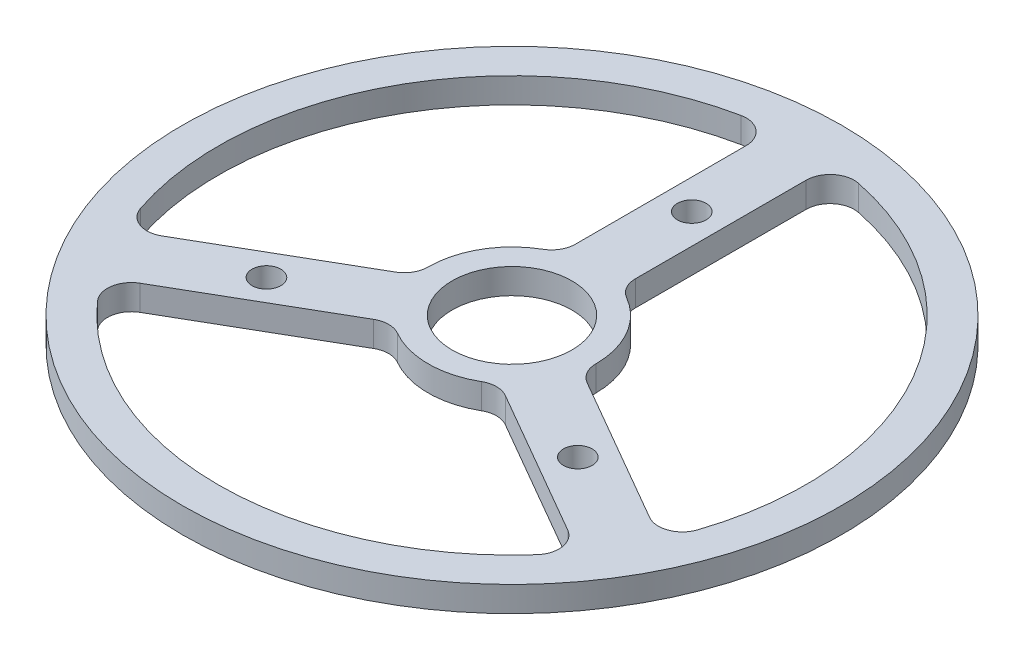
ISO-10303-21;
HEADER;
FILE_DESCRIPTION(('STEP AP214'),'2;1');
FILE_NAME('part.step','',(''),(''),'','','');
FILE_SCHEMA(('AUTOMOTIVE_DESIGN { 1 0 10303 214 1 1 1 1 }'));
ENDSEC;
DATA;
#1=APPLICATION_CONTEXT('core data for automotive mechanical design processes');
#2=APPLICATION_PROTOCOL_DEFINITION('international standard','automotive_design',2000,#1);
#3=PRODUCT_CONTEXT('',#1,'mechanical');
#4=PRODUCT('Part','Part','',(#3));
#5=PRODUCT_RELATED_PRODUCT_CATEGORY('part','',(#4));
#6=PRODUCT_DEFINITION_FORMATION('','',#4);
#7=PRODUCT_DEFINITION_CONTEXT('part definition',#1,'design');
#8=PRODUCT_DEFINITION('design','',#6,#7);
#9=PRODUCT_DEFINITION_SHAPE('','',#8);
#10=(LENGTH_UNIT() NAMED_UNIT(*) SI_UNIT(.MILLI.,.METRE.));
#11=(NAMED_UNIT(*) PLANE_ANGLE_UNIT() SI_UNIT($,.RADIAN.));
#12=(NAMED_UNIT(*) SI_UNIT($,.STERADIAN.) SOLID_ANGLE_UNIT());
#13=UNCERTAINTY_MEASURE_WITH_UNIT(LENGTH_MEASURE(1.E-05),#10,'distance_accuracy_value','');
#14=(GEOMETRIC_REPRESENTATION_CONTEXT(3) GLOBAL_UNCERTAINTY_ASSIGNED_CONTEXT((#13)) GLOBAL_UNIT_ASSIGNED_CONTEXT((#10,
#11,#12)) REPRESENTATION_CONTEXT('',''));
#15=CARTESIAN_POINT('',(0.,0.,0.));
#16=DIRECTION('',(0.,0.,1.));
#17=DIRECTION('',(1.,0.,0.));
#18=AXIS2_PLACEMENT_3D('',#15,#16,#17);
#19=CARTESIAN_POINT('',(0.,2.11,0.));
#20=DIRECTION('',(0.,-1.,0.));
#21=DIRECTION('',(0.,0.,-1.));
#22=AXIS2_PLACEMENT_3D('',#19,#20,#21);
#23=CYLINDRICAL_SURFACE('',#22,27.5);
#24=CARTESIAN_POINT('',(0.,2.11,0.));
#25=DIRECTION('',(0.,1.,0.));
#26=DIRECTION('',(0.,0.,1.));
#27=AXIS2_PLACEMENT_3D('',#24,#25,#26);
#28=CIRCLE('',#27,27.5);
#29=CARTESIAN_POINT('',(0.,2.11,27.5));
#30=VERTEX_POINT('',#29);
#31=EDGE_CURVE('E305',#30,#30,#28,.T.);
#32=ORIENTED_EDGE('',*,*,#31,.F.);
#33=EDGE_LOOP('',(#32));
#34=FACE_BOUND('',#33,.T.);
#35=CARTESIAN_POINT('',(0.,0.,0.));
#36=DIRECTION('',(0.,1.,0.));
#37=DIRECTION('',(0.,0.,1.));
#38=AXIS2_PLACEMENT_3D('',#35,#36,#37);
#39=CIRCLE('',#38,27.5);
#40=CARTESIAN_POINT('',(0.,0.,27.5));
#41=VERTEX_POINT('',#40);
#42=EDGE_CURVE('E302',#41,#41,#39,.T.);
#43=ORIENTED_EDGE('',*,*,#42,.T.);
#44=EDGE_LOOP('',(#43));
#45=FACE_BOUND('',#44,.T.);
#46=ADVANCED_FACE('F32',(#34,#45),#23,.T.);
#47=CARTESIAN_POINT('',(0.,2.11,0.));
#48=DIRECTION('',(0.,1.,0.));
#49=DIRECTION('',(0.,0.,1.));
#50=AXIS2_PLACEMENT_3D('',#47,#48,#49);
#51=PLANE('',#50);
#52=CARTESIAN_POINT('',(-12.9903810567656,2.11,7.50000000000056));
#53=DIRECTION('',(0.,1.,0.));
#54=DIRECTION('',(0.,0.,1.));
#55=AXIS2_PLACEMENT_3D('',#52,#53,#54);
#56=CIRCLE('',#55,1.20000000000122);
#57=CARTESIAN_POINT('',(-12.9903810567656,2.11,8.70000000000178));
#58=VERTEX_POINT('',#57);
#59=EDGE_CURVE('E245',#58,#58,#56,.T.);
#60=ORIENTED_EDGE('',*,*,#59,.F.);
#61=EDGE_LOOP('',(#60));
#62=FACE_BOUND('',#61,.T.);
#63=CARTESIAN_POINT('',(12.9903810567675,2.11,7.49999999999944));
#64=DIRECTION('',(0.,1.,0.));
#65=DIRECTION('',(0.,0.,1.));
#66=AXIS2_PLACEMENT_3D('',#63,#64,#65);
#67=CIRCLE('',#66,1.20000000000083);
#68=CARTESIAN_POINT('',(12.9903810567675,2.11,8.70000000000027));
#69=VERTEX_POINT('',#68);
#70=EDGE_CURVE('E261',#69,#69,#67,.T.);
#71=ORIENTED_EDGE('',*,*,#70,.F.);
#72=EDGE_LOOP('',(#71));
#73=FACE_BOUND('',#72,.T.);
#74=CARTESIAN_POINT('',(0.,2.11,-15.));
#75=DIRECTION('',(0.,1.,0.));
#76=DIRECTION('',(0.,0.,1.));
#77=AXIS2_PLACEMENT_3D('',#74,#75,#76);
#78=CIRCLE('',#77,1.2);
#79=CARTESIAN_POINT('',(0.,2.11,-13.8));
#80=VERTEX_POINT('',#79);
#81=EDGE_CURVE('E260',#80,#80,#78,.T.);
#82=ORIENTED_EDGE('',*,*,#81,.F.);
#83=EDGE_LOOP('',(#82));
#84=FACE_BOUND('',#83,.T.);
#85=CARTESIAN_POINT('',(0.,2.11,0.));
#86=DIRECTION('',(0.,-1.,0.));
#87=DIRECTION('',(0.,0.,1.));
#88=AXIS2_PLACEMENT_3D('',#85,#86,#87);
#89=CIRCLE('',#88,7.);
#90=CARTESIAN_POINT('',(-7.,2.11,0.));
#91=VERTEX_POINT('',#90);
#92=CARTESIAN_POINT('',(-3.5,2.11,-6.06217782649107));
#93=VERTEX_POINT('',#92);
#94=EDGE_CURVE('E283',#91,#93,#89,.T.);
#95=ORIENTED_EDGE('',*,*,#94,.F.);
#96=CARTESIAN_POINT('',(-9.,2.11,0.));
#97=DIRECTION('',(0.,1.,0.));
#98=DIRECTION('',(0.,0.,1.));
#99=AXIS2_PLACEMENT_3D('',#96,#97,#98);
#100=CIRCLE('',#99,2.);
#101=CARTESIAN_POINT('',(-8.,2.11,1.73205080756888));
#102=VERTEX_POINT('',#101);
#103=EDGE_CURVE('E375',#91,#102,#100,.F.);
#104=ORIENTED_EDGE('',*,*,#103,.T.);
#105=DIRECTION('',(0.866025403784439,0.,-0.5));
#106=VECTOR('',#105,1.);
#107=CARTESIAN_POINT('',(-6.91237582645306,2.11,1.10411069819441));
#108=LINE('',#107,#106);
#109=CARTESIAN_POINT('',(-20.3418830920368,2.11,8.85764033306321));
#110=VERTEX_POINT('',#109);
#111=EDGE_CURVE('E273',#110,#102,#108,.T.);
#112=ORIENTED_EDGE('',*,*,#111,.F.);
#113=CARTESIAN_POINT('',(-21.3418830920368,2.11,7.12558952549433));
#114=DIRECTION('',(0.,1.,0.));
#115=DIRECTION('',(0.,0.,1.));
#116=AXIS2_PLACEMENT_3D('',#113,#114,#115);
#117=CIRCLE('',#116,2.);
#118=CARTESIAN_POINT('',(-23.2389393668845,2.11,7.75897526109383));
#119=VERTEX_POINT('',#118);
#120=EDGE_CURVE('E383',#110,#119,#117,.F.);
#121=ORIENTED_EDGE('',*,*,#120,.T.);
#122=CARTESIAN_POINT('',(0.,2.11,0.));
#123=DIRECTION('',(0.,1.,0.));
#124=DIRECTION('',(0.,0.,1.));
#125=AXIS2_PLACEMENT_3D('',#122,#123,#124);
#126=CIRCLE('',#125,24.5);
#127=CARTESIAN_POINT('',(-4.9,2.11,-24.0049994792751));
#128=VERTEX_POINT('',#127);
#129=EDGE_CURVE('E290',#128,#119,#126,.T.);
#130=ORIENTED_EDGE('',*,*,#129,.F.);
#131=CARTESIAN_POINT('',(-4.5,2.11,-22.0454076850486));
#132=DIRECTION('',(0.,1.,0.));
#133=DIRECTION('',(0.,0.,1.));
#134=AXIS2_PLACEMENT_3D('',#131,#132,#133);
#135=CIRCLE('',#134,2.);
#136=CARTESIAN_POINT('',(-2.5,2.11,-22.0454076850486));
#137=VERTEX_POINT('',#136);
#138=EDGE_CURVE('E397',#128,#137,#135,.F.);
#139=ORIENTED_EDGE('',*,*,#138,.T.);
#140=DIRECTION('',(0.,0.,-1.));
#141=VECTOR('',#140,1.);
#142=CARTESIAN_POINT('',(-2.5,2.11,-6.53834841531101));
#143=LINE('',#142,#141);
#144=CARTESIAN_POINT('',(-2.5,2.11,-7.79422863405995));
#145=VERTEX_POINT('',#144);
#146=EDGE_CURVE('E286',#145,#137,#143,.T.);
#147=ORIENTED_EDGE('',*,*,#146,.F.);
#148=CARTESIAN_POINT('',(-4.5,2.11,-7.79422863405995));
#149=DIRECTION('',(0.,1.,0.));
#150=DIRECTION('',(0.,0.,1.));
#151=AXIS2_PLACEMENT_3D('',#148,#149,#150);
#152=CIRCLE('',#151,2.);
#153=EDGE_CURVE('E379',#145,#93,#152,.F.);
#154=ORIENTED_EDGE('',*,*,#153,.T.);
#155=EDGE_LOOP('',(#95,#104,#112,#121,#130,#139,#147,#154));
#156=FACE_BOUND('',#155,.T.);
#157=CARTESIAN_POINT('',(0.,2.11,0.));
#158=DIRECTION('',(0.,-1.,0.));
#159=DIRECTION('',(0.,0.,1.));
#160=AXIS2_PLACEMENT_3D('',#157,#158,#159);
#161=CIRCLE('',#160,7.);
#162=CARTESIAN_POINT('',(3.5,2.11,6.06217782649107));
#163=VERTEX_POINT('',#162);
#164=CARTESIAN_POINT('',(-3.5,2.11,6.06217782649107));
#165=VERTEX_POINT('',#164);
#166=EDGE_CURVE('E223',#163,#165,#161,.T.);
#167=ORIENTED_EDGE('',*,*,#166,.F.);
#168=CARTESIAN_POINT('',(4.5,2.11,7.79422863405995));
#169=DIRECTION('',(0.,1.,0.));
#170=DIRECTION('',(0.,0.,1.));
#171=AXIS2_PLACEMENT_3D('',#168,#169,#170);
#172=CIRCLE('',#171,2.);
#173=CARTESIAN_POINT('',(5.5,2.11,6.06217782649107));
#174=VERTEX_POINT('',#173);
#175=EDGE_CURVE('E363',#163,#174,#172,.F.);
#176=ORIENTED_EDGE('',*,*,#175,.T.);
#177=DIRECTION('',(-0.866025403784439,0.,-0.5));
#178=VECTOR('',#177,1.);
#179=CARTESIAN_POINT('',(4.41237582645306,2.11,5.4342377171166));
#180=LINE('',#179,#178);
#181=CARTESIAN_POINT('',(17.8418830920368,2.11,13.1877673519854));
#182=VERTEX_POINT('',#181);
#183=EDGE_CURVE('E226',#182,#174,#180,.T.);
#184=ORIENTED_EDGE('',*,*,#183,.F.);
#185=CARTESIAN_POINT('',(16.8418830920368,2.11,14.9198181595543));
#186=DIRECTION('',(0.,1.,0.));
#187=DIRECTION('',(0.,0.,1.));
#188=AXIS2_PLACEMENT_3D('',#185,#186,#187);
#189=CIRCLE('',#188,2.);
#190=CARTESIAN_POINT('',(18.3389393668845,2.11,16.2460242181813));
#191=VERTEX_POINT('',#190);
#192=EDGE_CURVE('E390',#182,#191,#189,.F.);
#193=ORIENTED_EDGE('',*,*,#192,.T.);
#194=CARTESIAN_POINT('',(0.,2.11,0.));
#195=DIRECTION('',(0.,1.,0.));
#196=DIRECTION('',(0.,0.,1.));
#197=AXIS2_PLACEMENT_3D('',#194,#195,#196);
#198=CIRCLE('',#197,24.5);
#199=CARTESIAN_POINT('',(-18.3389393668845,2.11,16.2460242181813));
#200=VERTEX_POINT('',#199);
#201=EDGE_CURVE('E222',#200,#191,#198,.T.);
#202=ORIENTED_EDGE('',*,*,#201,.F.);
#203=CARTESIAN_POINT('',(-16.8418830920368,2.11,14.9198181595543));
#204=DIRECTION('',(0.,1.,0.));
#205=DIRECTION('',(0.,0.,1.));
#206=AXIS2_PLACEMENT_3D('',#203,#204,#205);
#207=CIRCLE('',#206,2.);
#208=CARTESIAN_POINT('',(-17.8418830920368,2.11,13.1877673519854));
#209=VERTEX_POINT('',#208);
#210=EDGE_CURVE('E221',#200,#209,#207,.F.);
#211=ORIENTED_EDGE('',*,*,#210,.T.);
#212=DIRECTION('',(-0.866025403784438,0.,0.5));
#213=VECTOR('',#212,1.);
#214=CARTESIAN_POINT('',(-4.41237582645306,2.11,5.4342377171166));
#215=LINE('',#214,#213);
#216=CARTESIAN_POINT('',(-5.5,2.11,6.06217782649107));
#217=VERTEX_POINT('',#216);
#218=EDGE_CURVE('E211',#217,#209,#215,.T.);
#219=ORIENTED_EDGE('',*,*,#218,.F.);
#220=CARTESIAN_POINT('',(-4.5,2.11,7.79422863405995));
#221=DIRECTION('',(0.,1.,0.));
#222=DIRECTION('',(0.,0.,1.));
#223=AXIS2_PLACEMENT_3D('',#220,#221,#222);
#224=CIRCLE('',#223,2.);
#225=EDGE_CURVE('E194',#217,#165,#224,.F.);
#226=ORIENTED_EDGE('',*,*,#225,.T.);
#227=EDGE_LOOP('',(#167,#176,#184,#193,#202,#211,#219,#226));
#228=FACE_BOUND('',#227,.T.);
#229=CARTESIAN_POINT('',(0.,2.11,0.));
#230=DIRECTION('',(0.,-1.,0.));
#231=DIRECTION('',(0.,0.,1.));
#232=AXIS2_PLACEMENT_3D('',#229,#230,#231);
#233=CIRCLE('',#232,7.);
#234=CARTESIAN_POINT('',(3.5,2.11,-6.06217782649107));
#235=VERTEX_POINT('',#234);
#236=CARTESIAN_POINT('',(7.,2.11,0.));
#237=VERTEX_POINT('',#236);
#238=EDGE_CURVE('E246',#235,#237,#233,.T.);
#239=ORIENTED_EDGE('',*,*,#238,.F.);
#240=CARTESIAN_POINT('',(4.5,2.11,-7.79422863405995));
#241=DIRECTION('',(0.,1.,0.));
#242=DIRECTION('',(0.,0.,1.));
#243=AXIS2_PLACEMENT_3D('',#240,#241,#242);
#244=CIRCLE('',#243,2.);
#245=CARTESIAN_POINT('',(2.5,2.11,-7.79422863405995));
#246=VERTEX_POINT('',#245);
#247=EDGE_CURVE('E371',#235,#246,#244,.F.);
#248=ORIENTED_EDGE('',*,*,#247,.T.);
#249=DIRECTION('',(0.,0.,1.));
#250=VECTOR('',#249,1.);
#251=CARTESIAN_POINT('',(2.5,2.11,-6.53834841531101));
#252=LINE('',#251,#250);
#253=CARTESIAN_POINT('',(2.5,2.11,-22.0454076850486));
#254=VERTEX_POINT('',#253);
#255=EDGE_CURVE('E238',#254,#246,#252,.T.);
#256=ORIENTED_EDGE('',*,*,#255,.F.);
#257=CARTESIAN_POINT('',(4.5,2.11,-22.0454076850486));
#258=DIRECTION('',(0.,1.,0.));
#259=DIRECTION('',(0.,0.,1.));
#260=AXIS2_PLACEMENT_3D('',#257,#258,#259);
#261=CIRCLE('',#260,2.);
#262=CARTESIAN_POINT('',(4.9,2.11,-24.0049994792751));
#263=VERTEX_POINT('',#262);
#264=EDGE_CURVE('E40',#254,#263,#261,.F.);
#265=ORIENTED_EDGE('',*,*,#264,.T.);
#266=CARTESIAN_POINT('',(0.,2.11,0.));
#267=DIRECTION('',(0.,1.,0.));
#268=DIRECTION('',(0.,0.,1.));
#269=AXIS2_PLACEMENT_3D('',#266,#267,#268);
#270=CIRCLE('',#269,24.5);
#271=CARTESIAN_POINT('',(23.2389393668845,2.11,7.75897526109382));
#272=VERTEX_POINT('',#271);
#273=EDGE_CURVE('E253',#272,#263,#270,.T.);
#274=ORIENTED_EDGE('',*,*,#273,.F.);
#275=CARTESIAN_POINT('',(21.3418830920368,2.11,7.12558952549432));
#276=DIRECTION('',(0.,1.,0.));
#277=DIRECTION('',(0.,0.,1.));
#278=AXIS2_PLACEMENT_3D('',#275,#276,#277);
#279=CIRCLE('',#278,2.);
#280=CARTESIAN_POINT('',(20.3418830920368,2.11,8.8576403330632));
#281=VERTEX_POINT('',#280);
#282=EDGE_CURVE('E394',#272,#281,#279,.F.);
#283=ORIENTED_EDGE('',*,*,#282,.T.);
#284=DIRECTION('',(0.866025403784439,0.,0.5));
#285=VECTOR('',#284,1.);
#286=CARTESIAN_POINT('',(6.91237582645306,2.11,1.10411069819441));
#287=LINE('',#286,#285);
#288=CARTESIAN_POINT('',(8.,2.11,1.73205080756888));
#289=VERTEX_POINT('',#288);
#290=EDGE_CURVE('E249',#289,#281,#287,.T.);
#291=ORIENTED_EDGE('',*,*,#290,.F.);
#292=CARTESIAN_POINT('',(9.,2.11,0.));
#293=DIRECTION('',(0.,1.,0.));
#294=DIRECTION('',(0.,0.,1.));
#295=AXIS2_PLACEMENT_3D('',#292,#293,#294);
#296=CIRCLE('',#295,2.);
#297=EDGE_CURVE('E367',#289,#237,#296,.F.);
#298=ORIENTED_EDGE('',*,*,#297,.T.);
#299=EDGE_LOOP('',(#239,#248,#256,#265,#274,#283,#291,#298));
#300=FACE_BOUND('',#299,.T.);
#301=CARTESIAN_POINT('',(0.,2.11,0.));
#302=DIRECTION('',(0.,1.,0.));
#303=DIRECTION('',(0.,0.,1.));
#304=AXIS2_PLACEMENT_3D('',#301,#302,#303);
#305=CIRCLE('',#304,5.);
#306=CARTESIAN_POINT('',(0.,2.11,5.));
#307=VERTEX_POINT('',#306);
#308=EDGE_CURVE('E282',#307,#307,#305,.T.);
#309=ORIENTED_EDGE('',*,*,#308,.F.);
#310=EDGE_LOOP('',(#309));
#311=FACE_BOUND('',#310,.T.);
#312=ORIENTED_EDGE('',*,*,#31,.T.);
#313=EDGE_LOOP('',(#312));
#314=FACE_BOUND('',#313,.T.);
#315=ADVANCED_FACE('F218',(#62,#73,#84,#156,#228,#300,#311,#314),#51,.T.);
#316=CARTESIAN_POINT('',(0.,0.,0.));
#317=DIRECTION('',(0.,1.,0.));
#318=DIRECTION('',(0.,0.,1.));
#319=AXIS2_PLACEMENT_3D('',#316,#317,#318);
#320=PLANE('',#319);
#321=CARTESIAN_POINT('',(-12.9903810567656,0.,7.50000000000056));
#322=DIRECTION('',(0.,1.,0.));
#323=DIRECTION('',(0.,0.,1.));
#324=AXIS2_PLACEMENT_3D('',#321,#322,#323);
#325=CIRCLE('',#324,1.20000000000122);
#326=CARTESIAN_POINT('',(-12.9903810567656,0.,8.70000000000178));
#327=VERTEX_POINT('',#326);
#328=EDGE_CURVE('E264',#327,#327,#325,.T.);
#329=ORIENTED_EDGE('',*,*,#328,.T.);
#330=EDGE_LOOP('',(#329));
#331=FACE_BOUND('',#330,.T.);
#332=CARTESIAN_POINT('',(12.9903810567675,0.,7.49999999999944));
#333=DIRECTION('',(0.,1.,0.));
#334=DIRECTION('',(0.,0.,1.));
#335=AXIS2_PLACEMENT_3D('',#332,#333,#334);
#336=CIRCLE('',#335,1.20000000000083);
#337=CARTESIAN_POINT('',(12.9903810567675,0.,8.70000000000027));
#338=VERTEX_POINT('',#337);
#339=EDGE_CURVE('E257',#338,#338,#336,.T.);
#340=ORIENTED_EDGE('',*,*,#339,.T.);
#341=EDGE_LOOP('',(#340));
#342=FACE_BOUND('',#341,.T.);
#343=CARTESIAN_POINT('',(0.,0.,-15.));
#344=DIRECTION('',(0.,1.,0.));
#345=DIRECTION('',(0.,0.,1.));
#346=AXIS2_PLACEMENT_3D('',#343,#344,#345);
#347=CIRCLE('',#346,1.2);
#348=CARTESIAN_POINT('',(0.,0.,-13.8));
#349=VERTEX_POINT('',#348);
#350=EDGE_CURVE('E287',#349,#349,#347,.T.);
#351=ORIENTED_EDGE('',*,*,#350,.T.);
#352=EDGE_LOOP('',(#351));
#353=FACE_BOUND('',#352,.T.);
#354=CARTESIAN_POINT('',(0.,0.,0.));
#355=DIRECTION('',(0.,1.,0.));
#356=DIRECTION('',(0.,0.,1.));
#357=AXIS2_PLACEMENT_3D('',#354,#355,#356);
#358=CIRCLE('',#357,24.5);
#359=CARTESIAN_POINT('',(-4.9,0.,-24.0049994792751));
#360=VERTEX_POINT('',#359);
#361=CARTESIAN_POINT('',(-23.2389393668845,0.,7.75897526109383));
#362=VERTEX_POINT('',#361);
#363=EDGE_CURVE('E276',#360,#362,#358,.T.);
#364=ORIENTED_EDGE('',*,*,#363,.T.);
#365=CARTESIAN_POINT('',(-21.3418830920368,0.,7.12558952549433));
#366=DIRECTION('',(0.,1.,0.));
#367=DIRECTION('',(0.,0.,1.));
#368=AXIS2_PLACEMENT_3D('',#365,#366,#367);
#369=CIRCLE('',#368,2.);
#370=CARTESIAN_POINT('',(-20.3418830920368,0.,8.85764033306321));
#371=VERTEX_POINT('',#370);
#372=EDGE_CURVE('E385',#362,#371,#369,.T.);
#373=ORIENTED_EDGE('',*,*,#372,.T.);
#374=DIRECTION('',(0.866025403784439,0.,-0.5));
#375=VECTOR('',#374,1.);
#376=CARTESIAN_POINT('',(-6.91237582645306,0.,1.10411069819441));
#377=LINE('',#376,#375);
#378=CARTESIAN_POINT('',(-8.,0.,1.73205080756888));
#379=VERTEX_POINT('',#378);
#380=EDGE_CURVE('E279',#371,#379,#377,.T.);
#381=ORIENTED_EDGE('',*,*,#380,.T.);
#382=CARTESIAN_POINT('',(-9.,0.,0.));
#383=DIRECTION('',(0.,1.,0.));
#384=DIRECTION('',(0.,0.,1.));
#385=AXIS2_PLACEMENT_3D('',#382,#383,#384);
#386=CIRCLE('',#385,2.);
#387=CARTESIAN_POINT('',(-7.,0.,0.));
#388=VERTEX_POINT('',#387);
#389=EDGE_CURVE('E377',#379,#388,#386,.T.);
#390=ORIENTED_EDGE('',*,*,#389,.T.);
#391=CARTESIAN_POINT('',(0.,0.,0.));
#392=DIRECTION('',(0.,-1.,0.));
#393=DIRECTION('',(0.,0.,1.));
#394=AXIS2_PLACEMENT_3D('',#391,#392,#393);
#395=CIRCLE('',#394,7.);
#396=CARTESIAN_POINT('',(-3.5,0.,-6.06217782649107));
#397=VERTEX_POINT('',#396);
#398=EDGE_CURVE('E269',#388,#397,#395,.T.);
#399=ORIENTED_EDGE('',*,*,#398,.T.);
#400=CARTESIAN_POINT('',(-4.5,0.,-7.79422863405995));
#401=DIRECTION('',(0.,1.,0.));
#402=DIRECTION('',(0.,0.,1.));
#403=AXIS2_PLACEMENT_3D('',#400,#401,#402);
#404=CIRCLE('',#403,2.);
#405=CARTESIAN_POINT('',(-2.5,0.,-7.79422863405995));
#406=VERTEX_POINT('',#405);
#407=EDGE_CURVE('E381',#397,#406,#404,.T.);
#408=ORIENTED_EDGE('',*,*,#407,.T.);
#409=DIRECTION('',(0.,0.,-1.));
#410=VECTOR('',#409,1.);
#411=CARTESIAN_POINT('',(-2.5,0.,-6.53834841531101));
#412=LINE('',#411,#410);
#413=CARTESIAN_POINT('',(-2.5,0.,-22.0454076850486));
#414=VERTEX_POINT('',#413);
#415=EDGE_CURVE('E272',#406,#414,#412,.T.);
#416=ORIENTED_EDGE('',*,*,#415,.T.);
#417=CARTESIAN_POINT('',(-4.5,0.,-22.0454076850486));
#418=DIRECTION('',(0.,1.,0.));
#419=DIRECTION('',(0.,0.,1.));
#420=AXIS2_PLACEMENT_3D('',#417,#418,#419);
#421=CIRCLE('',#420,2.);
#422=EDGE_CURVE('E399',#414,#360,#421,.T.);
#423=ORIENTED_EDGE('',*,*,#422,.T.);
#424=EDGE_LOOP('',(#364,#373,#381,#390,#399,#408,#416,#423));
#425=FACE_BOUND('',#424,.T.);
#426=CARTESIAN_POINT('',(0.,0.,0.));
#427=DIRECTION('',(0.,1.,0.));
#428=DIRECTION('',(0.,0.,1.));
#429=AXIS2_PLACEMENT_3D('',#426,#427,#428);
#430=CIRCLE('',#429,24.5);
#431=CARTESIAN_POINT('',(-18.3389393668845,0.,16.2460242181813));
#432=VERTEX_POINT('',#431);
#433=CARTESIAN_POINT('',(18.3389393668845,0.,16.2460242181813));
#434=VERTEX_POINT('',#433);
#435=EDGE_CURVE('E490',#432,#434,#430,.T.);
#436=ORIENTED_EDGE('',*,*,#435,.T.);
#437=CARTESIAN_POINT('',(16.8418830920368,0.,14.9198181595543));
#438=DIRECTION('',(0.,1.,0.));
#439=DIRECTION('',(0.,0.,1.));
#440=AXIS2_PLACEMENT_3D('',#437,#438,#439);
#441=CIRCLE('',#440,2.);
#442=CARTESIAN_POINT('',(17.8418830920368,0.,13.1877673519854));
#443=VERTEX_POINT('',#442);
#444=EDGE_CURVE('E392',#434,#443,#441,.T.);
#445=ORIENTED_EDGE('',*,*,#444,.T.);
#446=DIRECTION('',(-0.866025403784439,0.,-0.5));
#447=VECTOR('',#446,1.);
#448=CARTESIAN_POINT('',(4.41237582645306,0.,5.4342377171166));
#449=LINE('',#448,#447);
#450=CARTESIAN_POINT('',(5.5,0.,6.06217782649107));
#451=VERTEX_POINT('',#450);
#452=EDGE_CURVE('E250',#443,#451,#449,.T.);
#453=ORIENTED_EDGE('',*,*,#452,.T.);
#454=CARTESIAN_POINT('',(4.5,0.,7.79422863405995));
#455=DIRECTION('',(0.,1.,0.));
#456=DIRECTION('',(0.,0.,1.));
#457=AXIS2_PLACEMENT_3D('',#454,#455,#456);
#458=CIRCLE('',#457,2.);
#459=CARTESIAN_POINT('',(3.5,0.,6.06217782649107));
#460=VERTEX_POINT('',#459);
#461=EDGE_CURVE('E365',#451,#460,#458,.T.);
#462=ORIENTED_EDGE('',*,*,#461,.T.);
#463=CARTESIAN_POINT('',(0.,0.,0.));
#464=DIRECTION('',(0.,-1.,0.));
#465=DIRECTION('',(0.,0.,1.));
#466=AXIS2_PLACEMENT_3D('',#463,#464,#465);
#467=CIRCLE('',#466,7.);
#468=CARTESIAN_POINT('',(-3.5,0.,6.06217782649107));
#469=VERTEX_POINT('',#468);
#470=EDGE_CURVE('E233',#460,#469,#467,.T.);
#471=ORIENTED_EDGE('',*,*,#470,.T.);
#472=CARTESIAN_POINT('',(-4.5,0.,7.79422863405995));
#473=DIRECTION('',(0.,1.,0.));
#474=DIRECTION('',(0.,0.,1.));
#475=AXIS2_PLACEMENT_3D('',#472,#473,#474);
#476=CIRCLE('',#475,2.);
#477=CARTESIAN_POINT('',(-5.5,0.,6.06217782649107));
#478=VERTEX_POINT('',#477);
#479=EDGE_CURVE('E204',#469,#478,#476,.T.);
#480=ORIENTED_EDGE('',*,*,#479,.T.);
#481=DIRECTION('',(-0.866025403784438,0.,0.5));
#482=VECTOR('',#481,1.);
#483=CARTESIAN_POINT('',(-4.41237582645306,0.,5.4342377171166));
#484=LINE('',#483,#482);
#485=CARTESIAN_POINT('',(-17.8418830920368,0.,13.1877673519854));
#486=VERTEX_POINT('',#485);
#487=EDGE_CURVE('E214',#478,#486,#484,.T.);
#488=ORIENTED_EDGE('',*,*,#487,.T.);
#489=CARTESIAN_POINT('',(-16.8418830920368,0.,14.9198181595543));
#490=DIRECTION('',(0.,1.,0.));
#491=DIRECTION('',(0.,0.,1.));
#492=AXIS2_PLACEMENT_3D('',#489,#490,#491);
#493=CIRCLE('',#492,2.);
#494=EDGE_CURVE('E388',#486,#432,#493,.T.);
#495=ORIENTED_EDGE('',*,*,#494,.T.);
#496=EDGE_LOOP('',(#436,#445,#453,#462,#471,#480,#488,#495));
#497=FACE_BOUND('',#496,.T.);
#498=CARTESIAN_POINT('',(0.,0.,0.));
#499=DIRECTION('',(0.,1.,0.));
#500=DIRECTION('',(0.,0.,1.));
#501=AXIS2_PLACEMENT_3D('',#498,#499,#500);
#502=CIRCLE('',#501,24.5);
#503=CARTESIAN_POINT('',(23.2389393668845,0.,7.75897526109382));
#504=VERTEX_POINT('',#503);
#505=CARTESIAN_POINT('',(4.9,0.,-24.0049994792751));
#506=VERTEX_POINT('',#505);
#507=EDGE_CURVE('E240',#504,#506,#502,.T.);
#508=ORIENTED_EDGE('',*,*,#507,.T.);
#509=CARTESIAN_POINT('',(4.5,0.,-22.0454076850486));
#510=DIRECTION('',(0.,1.,0.));
#511=DIRECTION('',(0.,0.,1.));
#512=AXIS2_PLACEMENT_3D('',#509,#510,#511);
#513=CIRCLE('',#512,2.);
#514=CARTESIAN_POINT('',(2.5,0.,-22.0454076850486));
#515=VERTEX_POINT('',#514);
#516=EDGE_CURVE('E11',#506,#515,#513,.T.);
#517=ORIENTED_EDGE('',*,*,#516,.T.);
#518=DIRECTION('',(0.,0.,1.));
#519=VECTOR('',#518,1.);
#520=CARTESIAN_POINT('',(2.5,0.,-6.53834841531101));
#521=LINE('',#520,#519);
#522=CARTESIAN_POINT('',(2.5,0.,-7.79422863405995));
#523=VERTEX_POINT('',#522);
#524=EDGE_CURVE('E242',#515,#523,#521,.T.);
#525=ORIENTED_EDGE('',*,*,#524,.T.);
#526=CARTESIAN_POINT('',(4.5,0.,-7.79422863405995));
#527=DIRECTION('',(0.,1.,0.));
#528=DIRECTION('',(0.,0.,1.));
#529=AXIS2_PLACEMENT_3D('',#526,#527,#528);
#530=CIRCLE('',#529,2.);
#531=CARTESIAN_POINT('',(3.5,0.,-6.06217782649107));
#532=VERTEX_POINT('',#531);
#533=EDGE_CURVE('E373',#523,#532,#530,.T.);
#534=ORIENTED_EDGE('',*,*,#533,.T.);
#535=CARTESIAN_POINT('',(0.,0.,0.));
#536=DIRECTION('',(0.,-1.,0.));
#537=DIRECTION('',(0.,0.,1.));
#538=AXIS2_PLACEMENT_3D('',#535,#536,#537);
#539=CIRCLE('',#538,7.);
#540=CARTESIAN_POINT('',(7.,0.,0.));
#541=VERTEX_POINT('',#540);
#542=EDGE_CURVE('E234',#532,#541,#539,.T.);
#543=ORIENTED_EDGE('',*,*,#542,.T.);
#544=CARTESIAN_POINT('',(9.,0.,0.));
#545=DIRECTION('',(0.,1.,0.));
#546=DIRECTION('',(0.,0.,1.));
#547=AXIS2_PLACEMENT_3D('',#544,#545,#546);
#548=CIRCLE('',#547,2.);
#549=CARTESIAN_POINT('',(8.,0.,1.73205080756888));
#550=VERTEX_POINT('',#549);
#551=EDGE_CURVE('E369',#541,#550,#548,.T.);
#552=ORIENTED_EDGE('',*,*,#551,.T.);
#553=DIRECTION('',(0.866025403784439,0.,0.5));
#554=VECTOR('',#553,1.);
#555=CARTESIAN_POINT('',(6.91237582645306,0.,1.10411069819441));
#556=LINE('',#555,#554);
#557=CARTESIAN_POINT('',(20.3418830920368,0.,8.8576403330632));
#558=VERTEX_POINT('',#557);
#559=EDGE_CURVE('E237',#550,#558,#556,.T.);
#560=ORIENTED_EDGE('',*,*,#559,.T.);
#561=CARTESIAN_POINT('',(21.3418830920368,0.,7.12558952549432));
#562=DIRECTION('',(0.,1.,0.));
#563=DIRECTION('',(0.,0.,1.));
#564=AXIS2_PLACEMENT_3D('',#561,#562,#563);
#565=CIRCLE('',#564,2.);
#566=EDGE_CURVE('E54',#558,#504,#565,.T.);
#567=ORIENTED_EDGE('',*,*,#566,.T.);
#568=EDGE_LOOP('',(#508,#517,#525,#534,#543,#552,#560,#567));
#569=FACE_BOUND('',#568,.T.);
#570=CARTESIAN_POINT('',(0.,0.,0.));
#571=DIRECTION('',(0.,1.,0.));
#572=DIRECTION('',(0.,0.,1.));
#573=AXIS2_PLACEMENT_3D('',#570,#571,#572);
#574=CIRCLE('',#573,5.);
#575=CARTESIAN_POINT('',(0.,0.,5.));
#576=VERTEX_POINT('',#575);
#577=EDGE_CURVE('E299',#576,#576,#574,.T.);
#578=ORIENTED_EDGE('',*,*,#577,.T.);
#579=EDGE_LOOP('',(#578));
#580=FACE_BOUND('',#579,.T.);
#581=ORIENTED_EDGE('',*,*,#42,.F.);
#582=EDGE_LOOP('',(#581));
#583=FACE_BOUND('',#582,.T.);
#584=ADVANCED_FACE('F410',(#331,#342,#353,#425,#497,#569,#580,#583),#320,.F.);
#585=CARTESIAN_POINT('',(0.,0.,0.));
#586=DIRECTION('',(0.,1.,0.));
#587=DIRECTION('',(0.,0.,1.));
#588=AXIS2_PLACEMENT_3D('',#585,#586,#587);
#589=CYLINDRICAL_SURFACE('',#588,5.);
#590=ORIENTED_EDGE('',*,*,#577,.F.);
#591=EDGE_LOOP('',(#590));
#592=FACE_BOUND('',#591,.T.);
#593=ORIENTED_EDGE('',*,*,#308,.T.);
#594=EDGE_LOOP('',(#593));
#595=FACE_BOUND('',#594,.T.);
#596=ADVANCED_FACE('F531',(#592,#595),#589,.F.);
#597=CARTESIAN_POINT('',(0.,0.,0.));
#598=DIRECTION('',(0.,1.,0.));
#599=DIRECTION('',(0.,0.,1.));
#600=AXIS2_PLACEMENT_3D('',#597,#598,#599);
#601=CYLINDRICAL_SURFACE('',#600,7.);
#602=ORIENTED_EDGE('',*,*,#238,.T.);
#603=DIRECTION('',(0.,1.,0.));
#604=VECTOR('',#603,1.);
#605=CARTESIAN_POINT('',(7.,0.,0.));
#606=LINE('',#605,#604);
#607=EDGE_CURVE('E327',#237,#541,#606,.F.);
#608=ORIENTED_EDGE('',*,*,#607,.T.);
#609=ORIENTED_EDGE('',*,*,#542,.F.);
#610=DIRECTION('',(0.,1.,0.));
#611=VECTOR('',#610,1.);
#612=CARTESIAN_POINT('',(3.5,0.,-6.06217782649107));
#613=LINE('',#612,#611);
#614=EDGE_CURVE('E324',#532,#235,#613,.T.);
#615=ORIENTED_EDGE('',*,*,#614,.T.);
#616=EDGE_LOOP('',(#602,#608,#609,#615));
#617=FACE_BOUND('',#616,.T.);
#618=ADVANCED_FACE('F422',(#617),#601,.T.);
#619=CARTESIAN_POINT('',(2.5,0.,-6.53834841531101));
#620=DIRECTION('',(-1.,0.,0.));
#621=DIRECTION('',(0.,0.,1.));
#622=AXIS2_PLACEMENT_3D('',#619,#620,#621);
#623=PLANE('',#622);
#624=ORIENTED_EDGE('',*,*,#255,.T.);
#625=DIRECTION('',(0.,-1.,0.));
#626=VECTOR('',#625,1.);
#627=CARTESIAN_POINT('',(2.5,0.,-7.79422863405995));
#628=LINE('',#627,#626);
#629=EDGE_CURVE('E332',#246,#523,#628,.T.);
#630=ORIENTED_EDGE('',*,*,#629,.T.);
#631=ORIENTED_EDGE('',*,*,#524,.F.);
#632=DIRECTION('',(0.,-1.,0.));
#633=VECTOR('',#632,1.);
#634=CARTESIAN_POINT('',(2.5,2.11,-22.0454076850486));
#635=LINE('',#634,#633);
#636=EDGE_CURVE('E329',#515,#254,#635,.F.);
#637=ORIENTED_EDGE('',*,*,#636,.T.);
#638=EDGE_LOOP('',(#624,#630,#631,#637));
#639=FACE_BOUND('',#638,.T.);
#640=ADVANCED_FACE('F414',(#639),#623,.F.);
#641=CARTESIAN_POINT('',(0.,0.,0.));
#642=DIRECTION('',(0.,1.,0.));
#643=DIRECTION('',(0.,0.,1.));
#644=AXIS2_PLACEMENT_3D('',#641,#642,#643);
#645=CYLINDRICAL_SURFACE('',#644,24.5);
#646=ORIENTED_EDGE('',*,*,#507,.F.);
#647=DIRECTION('',(0.,1.,0.));
#648=VECTOR('',#647,1.);
#649=CARTESIAN_POINT('',(23.2389393668845,0.,7.75897526109382));
#650=LINE('',#649,#648);
#651=EDGE_CURVE('E205',#504,#272,#650,.T.);
#652=ORIENTED_EDGE('',*,*,#651,.T.);
#653=ORIENTED_EDGE('',*,*,#273,.T.);
#654=DIRECTION('',(0.,1.,0.));
#655=VECTOR('',#654,1.);
#656=CARTESIAN_POINT('',(4.9,0.,-24.0049994792751));
#657=LINE('',#656,#655);
#658=EDGE_CURVE('E47',#263,#506,#657,.F.);
#659=ORIENTED_EDGE('',*,*,#658,.T.);
#660=EDGE_LOOP('',(#646,#652,#653,#659));
#661=FACE_BOUND('',#660,.T.);
#662=ADVANCED_FACE('F406',(#661),#645,.F.);
#663=CARTESIAN_POINT('',(6.91237582645306,0.,1.10411069819441));
#664=DIRECTION('',(-0.5,0.,0.866025403784439));
#665=DIRECTION('',(0.866025403784439,0.,0.5));
#666=AXIS2_PLACEMENT_3D('',#663,#664,#665);
#667=PLANE('',#666);
#668=ORIENTED_EDGE('',*,*,#559,.F.);
#669=DIRECTION('',(0.,-1.,0.));
#670=VECTOR('',#669,1.);
#671=CARTESIAN_POINT('',(8.,2.11,1.73205080756888));
#672=LINE('',#671,#670);
#673=EDGE_CURVE('E321',#550,#289,#672,.F.);
#674=ORIENTED_EDGE('',*,*,#673,.T.);
#675=ORIENTED_EDGE('',*,*,#290,.T.);
#676=DIRECTION('',(0.,-1.,0.));
#677=VECTOR('',#676,1.);
#678=CARTESIAN_POINT('',(20.3418830920368,0.,8.8576403330632));
#679=LINE('',#678,#677);
#680=EDGE_CURVE('E319',#281,#558,#679,.T.);
#681=ORIENTED_EDGE('',*,*,#680,.T.);
#682=EDGE_LOOP('',(#668,#674,#675,#681));
#683=FACE_BOUND('',#682,.T.);
#684=ADVANCED_FACE('F429',(#683),#667,.F.);
#685=CARTESIAN_POINT('',(0.,0.,0.));
#686=DIRECTION('',(0.,1.,0.));
#687=DIRECTION('',(0.,0.,1.));
#688=AXIS2_PLACEMENT_3D('',#685,#686,#687);
#689=CYLINDRICAL_SURFACE('',#688,7.);
#690=ORIENTED_EDGE('',*,*,#166,.T.);
#691=DIRECTION('',(0.,1.,0.));
#692=VECTOR('',#691,1.);
#693=CARTESIAN_POINT('',(-3.5,0.,6.06217782649107));
#694=LINE('',#693,#692);
#695=EDGE_CURVE('E199',#165,#469,#694,.F.);
#696=ORIENTED_EDGE('',*,*,#695,.T.);
#697=ORIENTED_EDGE('',*,*,#470,.F.);
#698=DIRECTION('',(0.,1.,0.));
#699=VECTOR('',#698,1.);
#700=CARTESIAN_POINT('',(3.5,0.,6.06217782649107));
#701=LINE('',#700,#699);
#702=EDGE_CURVE('E215',#460,#163,#701,.T.);
#703=ORIENTED_EDGE('',*,*,#702,.T.);
#704=EDGE_LOOP('',(#690,#696,#697,#703));
#705=FACE_BOUND('',#704,.T.);
#706=ADVANCED_FACE('F504',(#705),#689,.T.);
#707=CARTESIAN_POINT('',(4.41237582645306,0.,5.4342377171166));
#708=DIRECTION('',(0.5,0.,-0.866025403784439));
#709=DIRECTION('',(-0.866025403784439,0.,-0.5));
#710=AXIS2_PLACEMENT_3D('',#707,#708,#709);
#711=PLANE('',#710);
#712=ORIENTED_EDGE('',*,*,#183,.T.);
#713=DIRECTION('',(0.,-1.,0.));
#714=VECTOR('',#713,1.);
#715=CARTESIAN_POINT('',(5.5,0.,6.06217782649107));
#716=LINE('',#715,#714);
#717=EDGE_CURVE('E317',#174,#451,#716,.T.);
#718=ORIENTED_EDGE('',*,*,#717,.T.);
#719=ORIENTED_EDGE('',*,*,#452,.F.);
#720=DIRECTION('',(0.,-1.,0.));
#721=VECTOR('',#720,1.);
#722=CARTESIAN_POINT('',(17.8418830920368,2.11,13.1877673519854));
#723=LINE('',#722,#721);
#724=EDGE_CURVE('E314',#443,#182,#723,.F.);
#725=ORIENTED_EDGE('',*,*,#724,.T.);
#726=EDGE_LOOP('',(#712,#718,#719,#725));
#727=FACE_BOUND('',#726,.T.);
#728=ADVANCED_FACE('F508',(#727),#711,.F.);
#729=CARTESIAN_POINT('',(0.,0.,0.));
#730=DIRECTION('',(0.,1.,0.));
#731=DIRECTION('',(0.,0.,1.));
#732=AXIS2_PLACEMENT_3D('',#729,#730,#731);
#733=CYLINDRICAL_SURFACE('',#732,24.5);
#734=ORIENTED_EDGE('',*,*,#435,.F.);
#735=DIRECTION('',(0.,1.,0.));
#736=VECTOR('',#735,1.);
#737=CARTESIAN_POINT('',(-18.3389393668845,0.,16.2460242181813));
#738=LINE('',#737,#736);
#739=EDGE_CURVE('E356',#432,#200,#738,.T.);
#740=ORIENTED_EDGE('',*,*,#739,.T.);
#741=ORIENTED_EDGE('',*,*,#201,.T.);
#742=DIRECTION('',(0.,1.,0.));
#743=VECTOR('',#742,1.);
#744=CARTESIAN_POINT('',(18.3389393668845,0.,16.2460242181813));
#745=LINE('',#744,#743);
#746=EDGE_CURVE('E354',#191,#434,#745,.F.);
#747=ORIENTED_EDGE('',*,*,#746,.T.);
#748=EDGE_LOOP('',(#734,#740,#741,#747));
#749=FACE_BOUND('',#748,.T.);
#750=ADVANCED_FACE('F493',(#749),#733,.F.);
#751=CARTESIAN_POINT('',(-4.41237582645306,0.,5.4342377171166));
#752=DIRECTION('',(-0.5,0.,-0.866025403784438));
#753=DIRECTION('',(-0.866025403784439,0.,0.5));
#754=AXIS2_PLACEMENT_3D('',#751,#752,#753);
#755=PLANE('',#754);
#756=ORIENTED_EDGE('',*,*,#487,.F.);
#757=DIRECTION('',(0.,-1.,0.));
#758=VECTOR('',#757,1.);
#759=CARTESIAN_POINT('',(-5.5,2.11,6.06217782649107));
#760=LINE('',#759,#758);
#761=EDGE_CURVE('E198',#478,#217,#760,.F.);
#762=ORIENTED_EDGE('',*,*,#761,.T.);
#763=ORIENTED_EDGE('',*,*,#218,.T.);
#764=DIRECTION('',(0.,-1.,0.));
#765=VECTOR('',#764,1.);
#766=CARTESIAN_POINT('',(-17.8418830920368,0.,13.1877673519854));
#767=LINE('',#766,#765);
#768=EDGE_CURVE('E216',#209,#486,#767,.T.);
#769=ORIENTED_EDGE('',*,*,#768,.T.);
#770=EDGE_LOOP('',(#756,#762,#763,#769));
#771=FACE_BOUND('',#770,.T.);
#772=ADVANCED_FACE('F210',(#771),#755,.F.);
#773=CARTESIAN_POINT('',(0.,0.,0.));
#774=DIRECTION('',(0.,1.,0.));
#775=DIRECTION('',(0.,0.,1.));
#776=AXIS2_PLACEMENT_3D('',#773,#774,#775);
#777=CYLINDRICAL_SURFACE('',#776,7.);
#778=ORIENTED_EDGE('',*,*,#398,.F.);
#779=DIRECTION('',(0.,1.,0.));
#780=VECTOR('',#779,1.);
#781=CARTESIAN_POINT('',(-7.,0.,0.));
#782=LINE('',#781,#780);
#783=EDGE_CURVE('E336',#388,#91,#782,.T.);
#784=ORIENTED_EDGE('',*,*,#783,.T.);
#785=ORIENTED_EDGE('',*,*,#94,.T.);
#786=DIRECTION('',(0.,1.,0.));
#787=VECTOR('',#786,1.);
#788=CARTESIAN_POINT('',(-3.5,0.,-6.06217782649107));
#789=LINE('',#788,#787);
#790=EDGE_CURVE('E334',#93,#397,#789,.F.);
#791=ORIENTED_EDGE('',*,*,#790,.T.);
#792=EDGE_LOOP('',(#778,#784,#785,#791));
#793=FACE_BOUND('',#792,.T.);
#794=ADVANCED_FACE('F521',(#793),#777,.T.);
#795=CARTESIAN_POINT('',(-6.91237582645306,0.,1.10411069819441));
#796=DIRECTION('',(0.5,0.,0.866025403784439));
#797=DIRECTION('',(0.866025403784439,0.,-0.5));
#798=AXIS2_PLACEMENT_3D('',#795,#796,#797);
#799=PLANE('',#798);
#800=ORIENTED_EDGE('',*,*,#111,.T.);
#801=DIRECTION('',(0.,-1.,0.));
#802=VECTOR('',#801,1.);
#803=CARTESIAN_POINT('',(-8.,0.,1.73205080756888));
#804=LINE('',#803,#802);
#805=EDGE_CURVE('E342',#102,#379,#804,.T.);
#806=ORIENTED_EDGE('',*,*,#805,.T.);
#807=ORIENTED_EDGE('',*,*,#380,.F.);
#808=DIRECTION('',(0.,-1.,0.));
#809=VECTOR('',#808,1.);
#810=CARTESIAN_POINT('',(-20.3418830920368,2.11,8.85764033306321));
#811=LINE('',#810,#809);
#812=EDGE_CURVE('E339',#371,#110,#811,.F.);
#813=ORIENTED_EDGE('',*,*,#812,.T.);
#814=EDGE_LOOP('',(#800,#806,#807,#813));
#815=FACE_BOUND('',#814,.T.);
#816=ADVANCED_FACE('F540',(#815),#799,.F.);
#817=CARTESIAN_POINT('',(0.,0.,0.));
#818=DIRECTION('',(0.,1.,0.));
#819=DIRECTION('',(0.,0.,1.));
#820=AXIS2_PLACEMENT_3D('',#817,#818,#819);
#821=CYLINDRICAL_SURFACE('',#820,24.5);
#822=ORIENTED_EDGE('',*,*,#129,.T.);
#823=DIRECTION('',(0.,1.,0.));
#824=VECTOR('',#823,1.);
#825=CARTESIAN_POINT('',(-23.2389393668845,0.,7.75897526109383));
#826=LINE('',#825,#824);
#827=EDGE_CURVE('E352',#119,#362,#826,.F.);
#828=ORIENTED_EDGE('',*,*,#827,.T.);
#829=ORIENTED_EDGE('',*,*,#363,.F.);
#830=DIRECTION('',(0.,1.,0.));
#831=VECTOR('',#830,1.);
#832=CARTESIAN_POINT('',(-4.9,0.,-24.0049994792751));
#833=LINE('',#832,#831);
#834=EDGE_CURVE('E349',#360,#128,#833,.T.);
#835=ORIENTED_EDGE('',*,*,#834,.T.);
#836=EDGE_LOOP('',(#822,#828,#829,#835));
#837=FACE_BOUND('',#836,.T.);
#838=ADVANCED_FACE('F543',(#837),#821,.F.);
#839=CARTESIAN_POINT('',(-2.5,0.,-6.53834841531101));
#840=DIRECTION('',(1.,0.,0.));
#841=DIRECTION('',(0.,0.,-1.));
#842=AXIS2_PLACEMENT_3D('',#839,#840,#841);
#843=PLANE('',#842);
#844=ORIENTED_EDGE('',*,*,#415,.F.);
#845=DIRECTION('',(0.,-1.,0.));
#846=VECTOR('',#845,1.);
#847=CARTESIAN_POINT('',(-2.5,2.11,-7.79422863405995));
#848=LINE('',#847,#846);
#849=EDGE_CURVE('E346',#406,#145,#848,.F.);
#850=ORIENTED_EDGE('',*,*,#849,.T.);
#851=ORIENTED_EDGE('',*,*,#146,.T.);
#852=DIRECTION('',(0.,-1.,0.));
#853=VECTOR('',#852,1.);
#854=CARTESIAN_POINT('',(-2.5,0.,-22.0454076850486));
#855=LINE('',#854,#853);
#856=EDGE_CURVE('E344',#137,#414,#855,.T.);
#857=ORIENTED_EDGE('',*,*,#856,.T.);
#858=EDGE_LOOP('',(#844,#850,#851,#857));
#859=FACE_BOUND('',#858,.T.);
#860=ADVANCED_FACE('F547',(#859),#843,.F.);
#861=CARTESIAN_POINT('',(0.,0.,-15.));
#862=DIRECTION('',(0.,1.,0.));
#863=DIRECTION('',(0.,0.,1.));
#864=AXIS2_PLACEMENT_3D('',#861,#862,#863);
#865=CYLINDRICAL_SURFACE('',#864,1.2);
#866=ORIENTED_EDGE('',*,*,#350,.F.);
#867=EDGE_LOOP('',(#866));
#868=FACE_BOUND('',#867,.T.);
#869=ORIENTED_EDGE('',*,*,#81,.T.);
#870=EDGE_LOOP('',(#869));
#871=FACE_BOUND('',#870,.T.);
#872=ADVANCED_FACE('F535',(#868,#871),#865,.F.);
#873=CARTESIAN_POINT('',(12.9903810567675,0.,7.49999999999944));
#874=DIRECTION('',(0.,1.,0.));
#875=DIRECTION('',(0.,0.,1.));
#876=AXIS2_PLACEMENT_3D('',#873,#874,#875);
#877=CYLINDRICAL_SURFACE('',#876,1.20000000000083);
#878=ORIENTED_EDGE('',*,*,#339,.F.);
#879=EDGE_LOOP('',(#878));
#880=FACE_BOUND('',#879,.T.);
#881=ORIENTED_EDGE('',*,*,#70,.T.);
#882=EDGE_LOOP('',(#881));
#883=FACE_BOUND('',#882,.T.);
#884=ADVANCED_FACE('F532',(#880,#883),#877,.F.);
#885=CARTESIAN_POINT('',(-12.9903810567656,0.,7.50000000000056));
#886=DIRECTION('',(0.,1.,0.));
#887=DIRECTION('',(0.,0.,1.));
#888=AXIS2_PLACEMENT_3D('',#885,#886,#887);
#889=CYLINDRICAL_SURFACE('',#888,1.20000000000122);
#890=ORIENTED_EDGE('',*,*,#328,.F.);
#891=EDGE_LOOP('',(#890));
#892=FACE_BOUND('',#891,.T.);
#893=ORIENTED_EDGE('',*,*,#59,.T.);
#894=EDGE_LOOP('',(#893));
#895=FACE_BOUND('',#894,.T.);
#896=ADVANCED_FACE('F461',(#892,#895),#889,.F.);
#897=CARTESIAN_POINT('',(-4.5,0.,7.79422863405995));
#898=DIRECTION('',(0.,1.,0.));
#899=DIRECTION('',(0.,0.,1.));
#900=AXIS2_PLACEMENT_3D('',#897,#898,#899);
#901=CYLINDRICAL_SURFACE('',#900,2.);
#902=ORIENTED_EDGE('',*,*,#479,.F.);
#903=ORIENTED_EDGE('',*,*,#695,.F.);
#904=ORIENTED_EDGE('',*,*,#225,.F.);
#905=ORIENTED_EDGE('',*,*,#761,.F.);
#906=EDGE_LOOP('',(#902,#903,#904,#905));
#907=FACE_BOUND('',#906,.T.);
#908=ADVANCED_FACE('F197',(#907),#901,.F.);
#909=CARTESIAN_POINT('',(4.5,0.,7.79422863405995));
#910=DIRECTION('',(0.,1.,0.));
#911=DIRECTION('',(0.,0.,1.));
#912=AXIS2_PLACEMENT_3D('',#909,#910,#911);
#913=CYLINDRICAL_SURFACE('',#912,2.);
#914=ORIENTED_EDGE('',*,*,#461,.F.);
#915=ORIENTED_EDGE('',*,*,#717,.F.);
#916=ORIENTED_EDGE('',*,*,#175,.F.);
#917=ORIENTED_EDGE('',*,*,#702,.F.);
#918=EDGE_LOOP('',(#914,#915,#916,#917));
#919=FACE_BOUND('',#918,.T.);
#920=ADVANCED_FACE('F460',(#919),#913,.F.);
#921=CARTESIAN_POINT('',(9.,0.,0.));
#922=DIRECTION('',(0.,1.,0.));
#923=DIRECTION('',(0.,0.,1.));
#924=AXIS2_PLACEMENT_3D('',#921,#922,#923);
#925=CYLINDRICAL_SURFACE('',#924,2.);
#926=ORIENTED_EDGE('',*,*,#551,.F.);
#927=ORIENTED_EDGE('',*,*,#607,.F.);
#928=ORIENTED_EDGE('',*,*,#297,.F.);
#929=ORIENTED_EDGE('',*,*,#673,.F.);
#930=EDGE_LOOP('',(#926,#927,#928,#929));
#931=FACE_BOUND('',#930,.T.);
#932=ADVANCED_FACE('F425',(#931),#925,.F.);
#933=CARTESIAN_POINT('',(4.5,0.,-7.79422863405995));
#934=DIRECTION('',(0.,1.,0.));
#935=DIRECTION('',(0.,0.,1.));
#936=AXIS2_PLACEMENT_3D('',#933,#934,#935);
#937=CYLINDRICAL_SURFACE('',#936,2.);
#938=ORIENTED_EDGE('',*,*,#533,.F.);
#939=ORIENTED_EDGE('',*,*,#629,.F.);
#940=ORIENTED_EDGE('',*,*,#247,.F.);
#941=ORIENTED_EDGE('',*,*,#614,.F.);
#942=EDGE_LOOP('',(#938,#939,#940,#941));
#943=FACE_BOUND('',#942,.T.);
#944=ADVANCED_FACE('F417',(#943),#937,.F.);
#945=CARTESIAN_POINT('',(-9.,0.,0.));
#946=DIRECTION('',(0.,1.,0.));
#947=DIRECTION('',(0.,0.,1.));
#948=AXIS2_PLACEMENT_3D('',#945,#946,#947);
#949=CYLINDRICAL_SURFACE('',#948,2.);
#950=ORIENTED_EDGE('',*,*,#389,.F.);
#951=ORIENTED_EDGE('',*,*,#805,.F.);
#952=ORIENTED_EDGE('',*,*,#103,.F.);
#953=ORIENTED_EDGE('',*,*,#783,.F.);
#954=EDGE_LOOP('',(#950,#951,#952,#953));
#955=FACE_BOUND('',#954,.T.);
#956=ADVANCED_FACE('F469',(#955),#949,.F.);
#957=CARTESIAN_POINT('',(-4.5,0.,-7.79422863405995));
#958=DIRECTION('',(0.,1.,0.));
#959=DIRECTION('',(0.,0.,1.));
#960=AXIS2_PLACEMENT_3D('',#957,#958,#959);
#961=CYLINDRICAL_SURFACE('',#960,2.);
#962=ORIENTED_EDGE('',*,*,#407,.F.);
#963=ORIENTED_EDGE('',*,*,#790,.F.);
#964=ORIENTED_EDGE('',*,*,#153,.F.);
#965=ORIENTED_EDGE('',*,*,#849,.F.);
#966=EDGE_LOOP('',(#962,#963,#964,#965));
#967=FACE_BOUND('',#966,.T.);
#968=ADVANCED_FACE('F472',(#967),#961,.F.);
#969=CARTESIAN_POINT('',(-21.3418830920368,0.,7.12558952549433));
#970=DIRECTION('',(0.,1.,0.));
#971=DIRECTION('',(0.,0.,1.));
#972=AXIS2_PLACEMENT_3D('',#969,#970,#971);
#973=CYLINDRICAL_SURFACE('',#972,2.);
#974=ORIENTED_EDGE('',*,*,#372,.F.);
#975=ORIENTED_EDGE('',*,*,#827,.F.);
#976=ORIENTED_EDGE('',*,*,#120,.F.);
#977=ORIENTED_EDGE('',*,*,#812,.F.);
#978=EDGE_LOOP('',(#974,#975,#976,#977));
#979=FACE_BOUND('',#978,.T.);
#980=ADVANCED_FACE('F476',(#979),#973,.F.);
#981=CARTESIAN_POINT('',(-16.8418830920368,0.,14.9198181595543));
#982=DIRECTION('',(0.,1.,0.));
#983=DIRECTION('',(0.,0.,1.));
#984=AXIS2_PLACEMENT_3D('',#981,#982,#983);
#985=CYLINDRICAL_SURFACE('',#984,2.);
#986=ORIENTED_EDGE('',*,*,#494,.F.);
#987=ORIENTED_EDGE('',*,*,#768,.F.);
#988=ORIENTED_EDGE('',*,*,#210,.F.);
#989=ORIENTED_EDGE('',*,*,#739,.F.);
#990=EDGE_LOOP('',(#986,#987,#988,#989));
#991=FACE_BOUND('',#990,.T.);
#992=ADVANCED_FACE('F443',(#991),#985,.F.);
#993=CARTESIAN_POINT('',(16.8418830920368,0.,14.9198181595543));
#994=DIRECTION('',(0.,1.,0.));
#995=DIRECTION('',(0.,0.,1.));
#996=AXIS2_PLACEMENT_3D('',#993,#994,#995);
#997=CYLINDRICAL_SURFACE('',#996,2.);
#998=ORIENTED_EDGE('',*,*,#444,.F.);
#999=ORIENTED_EDGE('',*,*,#746,.F.);
#1000=ORIENTED_EDGE('',*,*,#192,.F.);
#1001=ORIENTED_EDGE('',*,*,#724,.F.);
#1002=EDGE_LOOP('',(#998,#999,#1000,#1001));
#1003=FACE_BOUND('',#1002,.T.);
#1004=ADVANCED_FACE('F436',(#1003),#997,.F.);
#1005=CARTESIAN_POINT('',(21.3418830920368,0.,7.12558952549432));
#1006=DIRECTION('',(0.,1.,0.));
#1007=DIRECTION('',(0.,0.,1.));
#1008=AXIS2_PLACEMENT_3D('',#1005,#1006,#1007);
#1009=CYLINDRICAL_SURFACE('',#1008,2.);
#1010=ORIENTED_EDGE('',*,*,#566,.F.);
#1011=ORIENTED_EDGE('',*,*,#680,.F.);
#1012=ORIENTED_EDGE('',*,*,#282,.F.);
#1013=ORIENTED_EDGE('',*,*,#651,.F.);
#1014=EDGE_LOOP('',(#1010,#1011,#1012,#1013));
#1015=FACE_BOUND('',#1014,.T.);
#1016=ADVANCED_FACE('F433',(#1015),#1009,.F.);
#1017=CARTESIAN_POINT('',(-4.5,0.,-22.0454076850486));
#1018=DIRECTION('',(0.,1.,0.));
#1019=DIRECTION('',(0.,0.,1.));
#1020=AXIS2_PLACEMENT_3D('',#1017,#1018,#1019);
#1021=CYLINDRICAL_SURFACE('',#1020,2.);
#1022=ORIENTED_EDGE('',*,*,#422,.F.);
#1023=ORIENTED_EDGE('',*,*,#856,.F.);
#1024=ORIENTED_EDGE('',*,*,#138,.F.);
#1025=ORIENTED_EDGE('',*,*,#834,.F.);
#1026=EDGE_LOOP('',(#1022,#1023,#1024,#1025));
#1027=FACE_BOUND('',#1026,.T.);
#1028=ADVANCED_FACE('F435',(#1027),#1021,.F.);
#1029=CARTESIAN_POINT('',(4.5,0.,-22.0454076850486));
#1030=DIRECTION('',(0.,1.,0.));
#1031=DIRECTION('',(0.,0.,1.));
#1032=AXIS2_PLACEMENT_3D('',#1029,#1030,#1031);
#1033=CYLINDRICAL_SURFACE('',#1032,2.);
#1034=ORIENTED_EDGE('',*,*,#516,.F.);
#1035=ORIENTED_EDGE('',*,*,#658,.F.);
#1036=ORIENTED_EDGE('',*,*,#264,.F.);
#1037=ORIENTED_EDGE('',*,*,#636,.F.);
#1038=EDGE_LOOP('',(#1034,#1035,#1036,#1037));
#1039=FACE_BOUND('',#1038,.T.);
#1040=ADVANCED_FACE('F34',(#1039),#1033,.F.);
#1041=CLOSED_SHELL('',(#46,#315,#584,#596,#618,#640,#662,#684,#706,#728,#750,#772,#794,#816,
#838,#860,#872,#884,#896,#908,#920,#932,#944,#956,#968,#980,#992,#1004,#1016,#1028,#1040));
#1042=MANIFOLD_SOLID_BREP('B2',#1041);
#1043=ADVANCED_BREP_SHAPE_REPRESENTATION('',(#18,#1042),#14);
#1044=SHAPE_DEFINITION_REPRESENTATION(#9,#1043);
ENDSEC;
END-ISO-10303-21;
